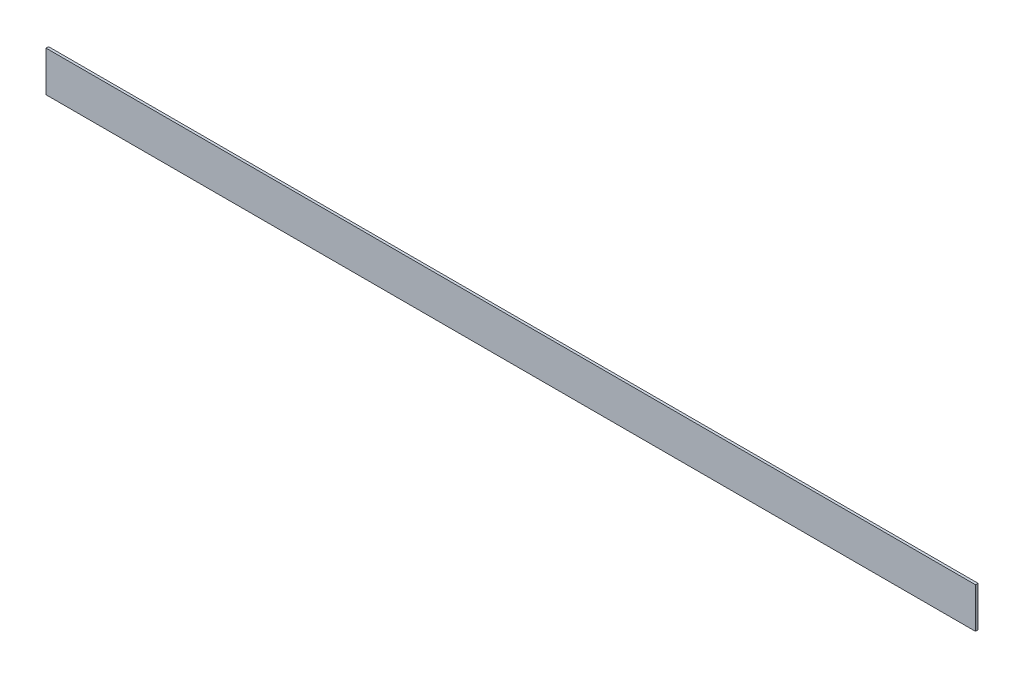
ISO-10303-21;
HEADER;
FILE_DESCRIPTION(('STEP AP214'),'2;1');
FILE_NAME('part.step','',(''),(''),'','','');
FILE_SCHEMA(('AUTOMOTIVE_DESIGN { 1 0 10303 214 1 1 1 1 }'));
ENDSEC;
DATA;
#1=APPLICATION_CONTEXT('core data for automotive mechanical design processes');
#2=APPLICATION_PROTOCOL_DEFINITION('international standard','automotive_design',2000,#1);
#3=PRODUCT_CONTEXT('',#1,'mechanical');
#4=PRODUCT('Part','Part','',(#3));
#5=PRODUCT_RELATED_PRODUCT_CATEGORY('part','',(#4));
#6=PRODUCT_DEFINITION_FORMATION('','',#4);
#7=PRODUCT_DEFINITION_CONTEXT('part definition',#1,'design');
#8=PRODUCT_DEFINITION('design','',#6,#7);
#9=PRODUCT_DEFINITION_SHAPE('','',#8);
#10=(LENGTH_UNIT() NAMED_UNIT(*) SI_UNIT(.MILLI.,.METRE.));
#11=(NAMED_UNIT(*) PLANE_ANGLE_UNIT() SI_UNIT($,.RADIAN.));
#12=(NAMED_UNIT(*) SI_UNIT($,.STERADIAN.) SOLID_ANGLE_UNIT());
#13=UNCERTAINTY_MEASURE_WITH_UNIT(LENGTH_MEASURE(1.E-05),#10,'distance_accuracy_value','');
#14=(GEOMETRIC_REPRESENTATION_CONTEXT(3) GLOBAL_UNCERTAINTY_ASSIGNED_CONTEXT((#13)) GLOBAL_UNIT_ASSIGNED_CONTEXT((#10,
#11,#12)) REPRESENTATION_CONTEXT('',''));
#15=CARTESIAN_POINT('',(0.,0.,0.));
#16=DIRECTION('',(0.,0.,1.));
#17=DIRECTION('',(1.,0.,0.));
#18=AXIS2_PLACEMENT_3D('',#15,#16,#17);
#19=CARTESIAN_POINT('',(292.1,12.7,1.5875));
#20=DIRECTION('',(-1.,0.,0.));
#21=DIRECTION('',(0.,0.,1.));
#22=AXIS2_PLACEMENT_3D('',#19,#20,#21);
#23=PLANE('',#22);
#24=DIRECTION('',(0.,1.,0.));
#25=VECTOR('',#24,1.);
#26=CARTESIAN_POINT('',(292.1,12.7,0.));
#27=LINE('',#26,#25);
#28=CARTESIAN_POINT('',(292.1,-12.7,0.));
#29=VERTEX_POINT('',#28);
#30=CARTESIAN_POINT('',(292.1,12.7,0.));
#31=VERTEX_POINT('',#30);
#32=EDGE_CURVE('E95',#29,#31,#27,.T.);
#33=ORIENTED_EDGE('',*,*,#32,.T.);
#34=DIRECTION('',(0.,0.,-1.));
#35=VECTOR('',#34,1.);
#36=CARTESIAN_POINT('',(292.1,12.7,1.5875));
#37=LINE('',#36,#35);
#38=CARTESIAN_POINT('',(292.1,12.7,1.5875));
#39=VERTEX_POINT('',#38);
#40=EDGE_CURVE('E11',#39,#31,#37,.T.);
#41=ORIENTED_EDGE('',*,*,#40,.F.);
#42=DIRECTION('',(0.,1.,0.));
#43=VECTOR('',#42,1.);
#44=CARTESIAN_POINT('',(292.1,12.7,1.5875));
#45=LINE('',#44,#43);
#46=CARTESIAN_POINT('',(292.1,-12.7,1.5875));
#47=VERTEX_POINT('',#46);
#48=EDGE_CURVE('E83',#47,#39,#45,.T.);
#49=ORIENTED_EDGE('',*,*,#48,.F.);
#50=DIRECTION('',(0.,0.,-1.));
#51=VECTOR('',#50,1.);
#52=CARTESIAN_POINT('',(292.1,-12.7,1.5875));
#53=LINE('',#52,#51);
#54=EDGE_CURVE('E91',#47,#29,#53,.T.);
#55=ORIENTED_EDGE('',*,*,#54,.T.);
#56=EDGE_LOOP('',(#33,#41,#49,#55));
#57=FACE_BOUND('',#56,.T.);
#58=ADVANCED_FACE('F32',(#57),#23,.F.);
#59=CARTESIAN_POINT('',(-292.1,12.7,1.5875));
#60=DIRECTION('',(0.,-1.,0.));
#61=DIRECTION('',(0.,0.,-1.));
#62=AXIS2_PLACEMENT_3D('',#59,#60,#61);
#63=PLANE('',#62);
#64=DIRECTION('',(-1.,0.,0.));
#65=VECTOR('',#64,1.);
#66=CARTESIAN_POINT('',(-292.1,12.7,0.));
#67=LINE('',#66,#65);
#68=CARTESIAN_POINT('',(-292.1,12.7,0.));
#69=VERTEX_POINT('',#68);
#70=EDGE_CURVE('E87',#31,#69,#67,.T.);
#71=ORIENTED_EDGE('',*,*,#70,.T.);
#72=DIRECTION('',(0.,0.,-1.));
#73=VECTOR('',#72,1.);
#74=CARTESIAN_POINT('',(-292.1,12.7,1.5875));
#75=LINE('',#74,#73);
#76=CARTESIAN_POINT('',(-292.1,12.7,1.5875));
#77=VERTEX_POINT('',#76);
#78=EDGE_CURVE('E40',#77,#69,#75,.T.);
#79=ORIENTED_EDGE('',*,*,#78,.F.);
#80=DIRECTION('',(-1.,0.,0.));
#81=VECTOR('',#80,1.);
#82=CARTESIAN_POINT('',(-292.1,12.7,1.5875));
#83=LINE('',#82,#81);
#84=EDGE_CURVE('E78',#39,#77,#83,.T.);
#85=ORIENTED_EDGE('',*,*,#84,.F.);
#86=ORIENTED_EDGE('',*,*,#40,.T.);
#87=EDGE_LOOP('',(#71,#79,#85,#86));
#88=FACE_BOUND('',#87,.T.);
#89=ADVANCED_FACE('F86',(#88),#63,.F.);
#90=CARTESIAN_POINT('',(-292.1,12.7,1.5875));
#91=DIRECTION('',(1.,0.,0.));
#92=DIRECTION('',(0.,0.,-1.));
#93=AXIS2_PLACEMENT_3D('',#90,#91,#92);
#94=PLANE('',#93);
#95=DIRECTION('',(0.,-1.,0.));
#96=VECTOR('',#95,1.);
#97=CARTESIAN_POINT('',(-292.1,12.7,0.));
#98=LINE('',#97,#96);
#99=CARTESIAN_POINT('',(-292.1,-12.7,0.));
#100=VERTEX_POINT('',#99);
#101=EDGE_CURVE('E65',#69,#100,#98,.T.);
#102=ORIENTED_EDGE('',*,*,#101,.T.);
#103=DIRECTION('',(0.,0.,-1.));
#104=VECTOR('',#103,1.);
#105=CARTESIAN_POINT('',(-292.1,-12.7,1.5875));
#106=LINE('',#105,#104);
#107=CARTESIAN_POINT('',(-292.1,-12.7,1.5875));
#108=VERTEX_POINT('',#107);
#109=EDGE_CURVE('E88',#108,#100,#106,.T.);
#110=ORIENTED_EDGE('',*,*,#109,.F.);
#111=DIRECTION('',(0.,-1.,0.));
#112=VECTOR('',#111,1.);
#113=CARTESIAN_POINT('',(-292.1,12.7,1.5875));
#114=LINE('',#113,#112);
#115=EDGE_CURVE('E81',#77,#108,#114,.T.);
#116=ORIENTED_EDGE('',*,*,#115,.F.);
#117=ORIENTED_EDGE('',*,*,#78,.T.);
#118=EDGE_LOOP('',(#102,#110,#116,#117));
#119=FACE_BOUND('',#118,.T.);
#120=ADVANCED_FACE('F89',(#119),#94,.F.);
#121=CARTESIAN_POINT('',(-292.1,-12.7,1.5875));
#122=DIRECTION('',(0.,1.,0.));
#123=DIRECTION('',(0.,0.,1.));
#124=AXIS2_PLACEMENT_3D('',#121,#122,#123);
#125=PLANE('',#124);
#126=DIRECTION('',(1.,0.,0.));
#127=VECTOR('',#126,1.);
#128=CARTESIAN_POINT('',(-292.1,-12.7,0.));
#129=LINE('',#128,#127);
#130=EDGE_CURVE('E71',#100,#29,#129,.T.);
#131=ORIENTED_EDGE('',*,*,#130,.T.);
#132=ORIENTED_EDGE('',*,*,#54,.F.);
#133=DIRECTION('',(1.,0.,0.));
#134=VECTOR('',#133,1.);
#135=CARTESIAN_POINT('',(-292.1,-12.7,1.5875));
#136=LINE('',#135,#134);
#137=EDGE_CURVE('E48',#108,#47,#136,.T.);
#138=ORIENTED_EDGE('',*,*,#137,.F.);
#139=ORIENTED_EDGE('',*,*,#109,.T.);
#140=EDGE_LOOP('',(#131,#132,#138,#139));
#141=FACE_BOUND('',#140,.T.);
#142=ADVANCED_FACE('F102',(#141),#125,.F.);
#143=CARTESIAN_POINT('',(0.,0.,1.5875));
#144=DIRECTION('',(0.,0.,1.));
#145=DIRECTION('',(1.,0.,0.));
#146=AXIS2_PLACEMENT_3D('',#143,#144,#145);
#147=PLANE('',#146);
#148=ORIENTED_EDGE('',*,*,#48,.T.);
#149=ORIENTED_EDGE('',*,*,#84,.T.);
#150=ORIENTED_EDGE('',*,*,#115,.T.);
#151=ORIENTED_EDGE('',*,*,#137,.T.);
#152=EDGE_LOOP('',(#148,#149,#150,#151));
#153=FACE_BOUND('',#152,.T.);
#154=ADVANCED_FACE('F79',(#153),#147,.T.);
#155=CARTESIAN_POINT('',(0.,0.,0.));
#156=DIRECTION('',(0.,0.,1.));
#157=DIRECTION('',(1.,0.,0.));
#158=AXIS2_PLACEMENT_3D('',#155,#156,#157);
#159=PLANE('',#158);
#160=ORIENTED_EDGE('',*,*,#32,.F.);
#161=ORIENTED_EDGE('',*,*,#130,.F.);
#162=ORIENTED_EDGE('',*,*,#101,.F.);
#163=ORIENTED_EDGE('',*,*,#70,.F.);
#164=EDGE_LOOP('',(#160,#161,#162,#163));
#165=FACE_BOUND('',#164,.T.);
#166=ADVANCED_FACE('F105',(#165),#159,.F.);
#167=CLOSED_SHELL('',(#58,#89,#120,#142,#154,#166));
#168=MANIFOLD_SOLID_BREP('B2',#167);
#169=ADVANCED_BREP_SHAPE_REPRESENTATION('',(#18,#168),#14);
#170=SHAPE_DEFINITION_REPRESENTATION(#9,#169);
ENDSEC;
END-ISO-10303-21;
